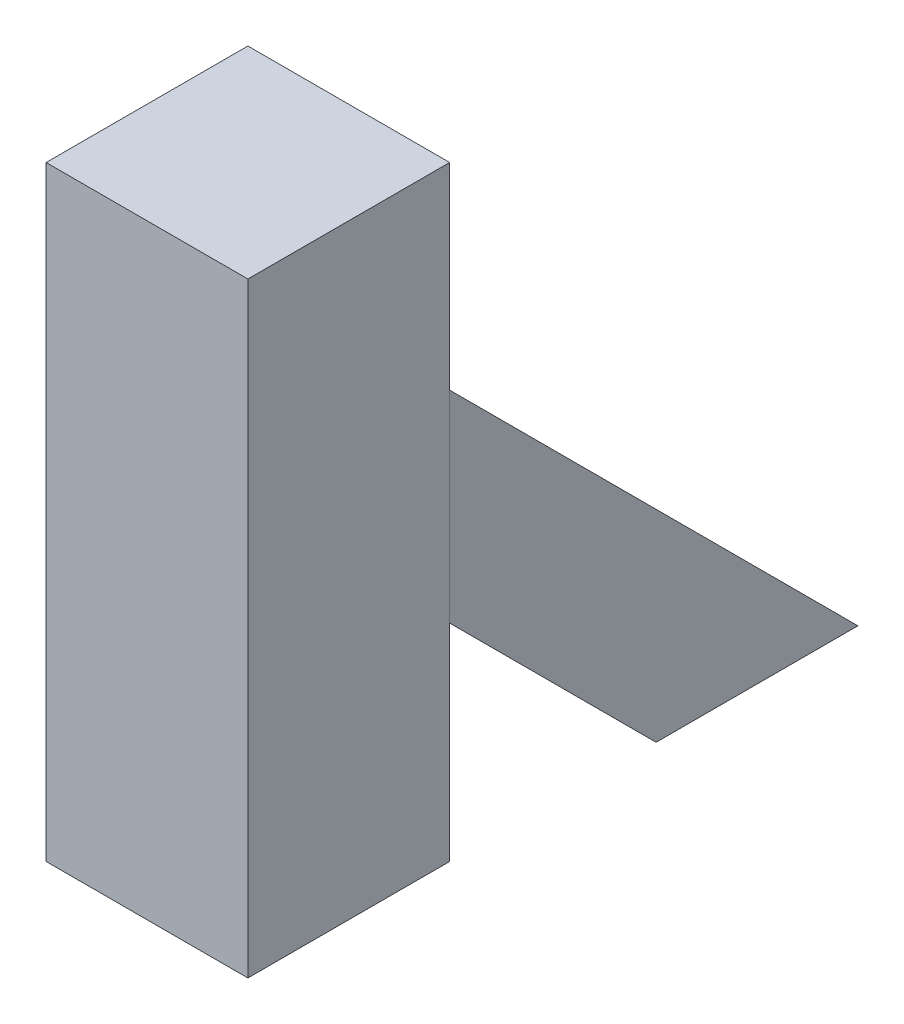
ISO-10303-21;
HEADER;
FILE_DESCRIPTION(('STEP AP214'),'2;1');
FILE_NAME('part.step','',(''),(''),'','','');
FILE_SCHEMA(('AUTOMOTIVE_DESIGN { 1 0 10303 214 1 1 1 1 }'));
ENDSEC;
DATA;
#1=APPLICATION_CONTEXT('core data for automotive mechanical design processes');
#2=APPLICATION_PROTOCOL_DEFINITION('international standard','automotive_design',2000,#1);
#3=PRODUCT_CONTEXT('',#1,'mechanical');
#4=PRODUCT('Part','Part','',(#3));
#5=PRODUCT_RELATED_PRODUCT_CATEGORY('part','',(#4));
#6=PRODUCT_DEFINITION_FORMATION('','',#4);
#7=PRODUCT_DEFINITION_CONTEXT('part definition',#1,'design');
#8=PRODUCT_DEFINITION('design','',#6,#7);
#9=PRODUCT_DEFINITION_SHAPE('','',#8);
#10=(LENGTH_UNIT() NAMED_UNIT(*) SI_UNIT(.MILLI.,.METRE.));
#11=(NAMED_UNIT(*) PLANE_ANGLE_UNIT() SI_UNIT($,.RADIAN.));
#12=(NAMED_UNIT(*) SI_UNIT($,.STERADIAN.) SOLID_ANGLE_UNIT());
#13=UNCERTAINTY_MEASURE_WITH_UNIT(LENGTH_MEASURE(1.E-05),#10,'distance_accuracy_value','');
#14=(GEOMETRIC_REPRESENTATION_CONTEXT(3) GLOBAL_UNCERTAINTY_ASSIGNED_CONTEXT((#13)) GLOBAL_UNIT_ASSIGNED_CONTEXT((#10,
#11,#12)) REPRESENTATION_CONTEXT('',''));
#15=CARTESIAN_POINT('',(0.,0.,0.));
#16=DIRECTION('',(0.,0.,1.));
#17=DIRECTION('',(1.,0.,0.));
#18=AXIS2_PLACEMENT_3D('',#15,#16,#17);
#19=CARTESIAN_POINT('',(-49.9999999999999,202.313201964456,-49.9999999999998));
#20=DIRECTION('',(0.,0.,1.));
#21=DIRECTION('',(1.,0.,0.));
#22=AXIS2_PLACEMENT_3D('',#19,#20,#21);
#23=PLANE('',#22);
#24=DIRECTION('',(0.,-1.,0.));
#25=VECTOR('',#24,1.);
#26=CARTESIAN_POINT('',(50.0000000000001,202.313201964456,-49.9999999999998));
#27=LINE('',#26,#25);
#28=CARTESIAN_POINT('',(50.0000000000001,202.313201964456,-49.9999999999998));
#29=VERTEX_POINT('',#28);
#30=CARTESIAN_POINT('',(50.0000000000001,102.313201964456,-49.9999999999998));
#31=VERTEX_POINT('',#30);
#32=EDGE_CURVE('E113',#29,#31,#27,.T.);
#33=ORIENTED_EDGE('',*,*,#32,.F.);
#34=DIRECTION('',(1.,0.,0.));
#35=VECTOR('',#34,1.);
#36=CARTESIAN_POINT('',(-49.9999999999999,202.313201964456,-49.9999999999998));
#37=LINE('',#36,#35);
#38=CARTESIAN_POINT('',(-49.9999999999999,202.313201964456,-49.9999999999998));
#39=VERTEX_POINT('',#38);
#40=EDGE_CURVE('E12',#39,#29,#37,.T.);
#41=ORIENTED_EDGE('',*,*,#40,.F.);
#42=DIRECTION('',(0.,-1.,0.));
#43=VECTOR('',#42,1.);
#44=CARTESIAN_POINT('',(-49.9999999999999,202.313201964456,-49.9999999999998));
#45=LINE('',#44,#43);
#46=CARTESIAN_POINT('',(-49.9999999999999,102.313201964456,-49.9999999999998));
#47=VERTEX_POINT('',#46);
#48=EDGE_CURVE('E107',#39,#47,#45,.T.);
#49=ORIENTED_EDGE('',*,*,#48,.T.);
#50=DIRECTION('',(1.,0.,0.));
#51=VECTOR('',#50,1.);
#52=CARTESIAN_POINT('',(-49.9999999999999,102.313201964456,-49.9999999999998));
#53=LINE('',#52,#51);
#54=EDGE_CURVE('E52',#47,#31,#53,.T.);
#55=ORIENTED_EDGE('',*,*,#54,.T.);
#56=EDGE_LOOP('',(#33,#41,#49,#55));
#57=FACE_BOUND('',#56,.T.);
#58=ADVANCED_FACE('F49',(#57),#23,.T.);
#59=CARTESIAN_POINT('',(-49.9999999999999,202.313201964456,-49.9999999999998));
#60=DIRECTION('',(0.,0.707106781186552,-0.707106781186543));
#61=DIRECTION('',(0.,0.707106781186543,0.707106781186552));
#62=AXIS2_PLACEMENT_3D('',#59,#60,#61);
#63=PLANE('',#62);
#64=DIRECTION('',(0.,0.707106781186543,0.707106781186551));
#65=VECTOR('',#64,1.);
#66=CARTESIAN_POINT('',(50.0000000000001,202.313201964456,-49.9999999999998));
#67=LINE('',#66,#65);
#68=CARTESIAN_POINT('',(50.0000000000001,0.,-252.313201964458));
#69=VERTEX_POINT('',#68);
#70=EDGE_CURVE('E109',#69,#29,#67,.T.);
#71=ORIENTED_EDGE('',*,*,#70,.F.);
#72=DIRECTION('',(1.,0.,0.));
#73=VECTOR('',#72,1.);
#74=CARTESIAN_POINT('',(-49.9999999999999,0.,-252.313201964458));
#75=LINE('',#74,#73);
#76=CARTESIAN_POINT('',(-49.9999999999999,0.,-252.313201964458));
#77=VERTEX_POINT('',#76);
#78=EDGE_CURVE('E58',#77,#69,#75,.T.);
#79=ORIENTED_EDGE('',*,*,#78,.F.);
#80=DIRECTION('',(0.,0.707106781186543,0.707106781186551));
#81=VECTOR('',#80,1.);
#82=CARTESIAN_POINT('',(-49.9999999999999,202.313201964456,-49.9999999999998));
#83=LINE('',#82,#81);
#84=EDGE_CURVE('E104',#77,#39,#83,.T.);
#85=ORIENTED_EDGE('',*,*,#84,.T.);
#86=ORIENTED_EDGE('',*,*,#40,.T.);
#87=EDGE_LOOP('',(#71,#79,#85,#86));
#88=FACE_BOUND('',#87,.T.);
#89=ADVANCED_FACE('F123',(#88),#63,.T.);
#90=CARTESIAN_POINT('',(-49.9999999999999,0.,-252.313201964458));
#91=DIRECTION('',(0.,-1.,0.));
#92=DIRECTION('',(0.,0.,-1.));
#93=AXIS2_PLACEMENT_3D('',#90,#91,#92);
#94=PLANE('',#93);
#95=DIRECTION('',(0.,0.,-1.));
#96=VECTOR('',#95,1.);
#97=CARTESIAN_POINT('',(50.0000000000001,0.,-252.313201964458));
#98=LINE('',#97,#96);
#99=CARTESIAN_POINT('',(50.0000000000001,0.,-152.313201964457));
#100=VERTEX_POINT('',#99);
#101=EDGE_CURVE('E99',#100,#69,#98,.T.);
#102=ORIENTED_EDGE('',*,*,#101,.F.);
#103=DIRECTION('',(1.,0.,0.));
#104=VECTOR('',#103,1.);
#105=CARTESIAN_POINT('',(-49.9999999999999,0.,-152.313201964457));
#106=LINE('',#105,#104);
#107=CARTESIAN_POINT('',(-49.9999999999999,0.,-152.313201964457));
#108=VERTEX_POINT('',#107);
#109=EDGE_CURVE('E94',#108,#100,#106,.T.);
#110=ORIENTED_EDGE('',*,*,#109,.F.);
#111=DIRECTION('',(0.,0.,-1.));
#112=VECTOR('',#111,1.);
#113=CARTESIAN_POINT('',(-49.9999999999999,0.,-252.313201964458));
#114=LINE('',#113,#112);
#115=EDGE_CURVE('E97',#108,#77,#114,.T.);
#116=ORIENTED_EDGE('',*,*,#115,.T.);
#117=ORIENTED_EDGE('',*,*,#78,.T.);
#118=EDGE_LOOP('',(#102,#110,#116,#117));
#119=FACE_BOUND('',#118,.T.);
#120=ADVANCED_FACE('F96',(#119),#94,.T.);
#121=CARTESIAN_POINT('',(-49.9999999999999,0.,-152.313201964457));
#122=DIRECTION('',(0.,-0.707106781186552,0.707106781186544));
#123=DIRECTION('',(0.,-0.707106781186544,-0.707106781186551));
#124=AXIS2_PLACEMENT_3D('',#121,#122,#123);
#125=PLANE('',#124);
#126=DIRECTION('',(0.,-0.707106781186544,-0.707106781186551));
#127=VECTOR('',#126,1.);
#128=CARTESIAN_POINT('',(50.0000000000001,0.,-152.313201964457));
#129=LINE('',#128,#127);
#130=EDGE_CURVE('E116',#31,#100,#129,.T.);
#131=ORIENTED_EDGE('',*,*,#130,.F.);
#132=ORIENTED_EDGE('',*,*,#54,.F.);
#133=DIRECTION('',(0.,-0.707106781186544,-0.707106781186551));
#134=VECTOR('',#133,1.);
#135=CARTESIAN_POINT('',(-49.9999999999999,0.,-152.313201964457));
#136=LINE('',#135,#134);
#137=EDGE_CURVE('E103',#47,#108,#136,.T.);
#138=ORIENTED_EDGE('',*,*,#137,.T.);
#139=ORIENTED_EDGE('',*,*,#109,.T.);
#140=EDGE_LOOP('',(#131,#132,#138,#139));
#141=FACE_BOUND('',#140,.T.);
#142=ADVANCED_FACE('F106',(#141),#125,.T.);
#143=CARTESIAN_POINT('',(-49.9999999999999,0.,0.));
#144=DIRECTION('',(-1.,0.,0.));
#145=DIRECTION('',(0.,0.,1.));
#146=AXIS2_PLACEMENT_3D('',#143,#144,#145);
#147=PLANE('',#146);
#148=ORIENTED_EDGE('',*,*,#48,.F.);
#149=ORIENTED_EDGE('',*,*,#84,.F.);
#150=ORIENTED_EDGE('',*,*,#115,.F.);
#151=ORIENTED_EDGE('',*,*,#137,.F.);
#152=EDGE_LOOP('',(#148,#149,#150,#151));
#153=FACE_BOUND('',#152,.T.);
#154=ADVANCED_FACE('F102',(#153),#147,.T.);
#155=CARTESIAN_POINT('',(50.0000000000001,0.,0.));
#156=DIRECTION('',(-1.,0.,0.));
#157=DIRECTION('',(0.,0.,1.));
#158=AXIS2_PLACEMENT_3D('',#155,#156,#157);
#159=PLANE('',#158);
#160=ORIENTED_EDGE('',*,*,#32,.T.);
#161=ORIENTED_EDGE('',*,*,#130,.T.);
#162=ORIENTED_EDGE('',*,*,#101,.T.);
#163=ORIENTED_EDGE('',*,*,#70,.T.);
#164=EDGE_LOOP('',(#160,#161,#162,#163));
#165=FACE_BOUND('',#164,.T.);
#166=ADVANCED_FACE('F122',(#165),#159,.F.);
#167=CLOSED_SHELL('',(#58,#89,#120,#142,#154,#166));
#168=MANIFOLD_SOLID_BREP('B2',#167);
#169=CARTESIAN_POINT('',(-49.9999999999999,300.,50.0000000000002));
#170=DIRECTION('',(1.,0.,0.));
#171=DIRECTION('',(0.,0.,-1.));
#172=AXIS2_PLACEMENT_3D('',#169,#170,#171);
#173=PLANE('',#172);
#174=DIRECTION('',(0.,0.,1.));
#175=VECTOR('',#174,1.);
#176=CARTESIAN_POINT('',(-49.9999999999999,0.,50.0000000000002));
#177=LINE('',#176,#175);
#178=CARTESIAN_POINT('',(-49.9999999999999,0.,-49.9999999999998));
#179=VERTEX_POINT('',#178);
#180=CARTESIAN_POINT('',(-49.9999999999999,0.,50.0000000000002));
#181=VERTEX_POINT('',#180);
#182=EDGE_CURVE('E241',#179,#181,#177,.T.);
#183=ORIENTED_EDGE('',*,*,#182,.T.);
#184=DIRECTION('',(0.,-1.,0.));
#185=VECTOR('',#184,1.);
#186=CARTESIAN_POINT('',(-49.9999999999999,300.,50.0000000000002));
#187=LINE('',#186,#185);
#188=CARTESIAN_POINT('',(-49.9999999999999,300.,50.0000000000002));
#189=VERTEX_POINT('',#188);
#190=EDGE_CURVE('E47',#189,#181,#187,.T.);
#191=ORIENTED_EDGE('',*,*,#190,.F.);
#192=DIRECTION('',(0.,0.,1.));
#193=VECTOR('',#192,1.);
#194=CARTESIAN_POINT('',(-49.9999999999999,300.,50.0000000000002));
#195=LINE('',#194,#193);
#196=CARTESIAN_POINT('',(-49.9999999999999,300.,-49.9999999999998));
#197=VERTEX_POINT('',#196);
#198=EDGE_CURVE('E225',#197,#189,#195,.T.);
#199=ORIENTED_EDGE('',*,*,#198,.F.);
#200=DIRECTION('',(0.,-1.,0.));
#201=VECTOR('',#200,1.);
#202=CARTESIAN_POINT('',(-49.9999999999999,300.,-49.9999999999998));
#203=LINE('',#202,#201);
#204=EDGE_CURVE('E237',#197,#179,#203,.T.);
#205=ORIENTED_EDGE('',*,*,#204,.T.);
#206=EDGE_LOOP('',(#183,#191,#199,#205));
#207=FACE_BOUND('',#206,.T.);
#208=ADVANCED_FACE('F173',(#207),#173,.F.);
#209=CARTESIAN_POINT('',(50.0000000000001,300.,50.0000000000002));
#210=DIRECTION('',(0.,0.,-1.));
#211=DIRECTION('',(-1.,0.,0.));
#212=AXIS2_PLACEMENT_3D('',#209,#210,#211);
#213=PLANE('',#212);
#214=DIRECTION('',(1.,0.,0.));
#215=VECTOR('',#214,1.);
#216=CARTESIAN_POINT('',(50.0000000000001,0.,50.0000000000002));
#217=LINE('',#216,#215);
#218=CARTESIAN_POINT('',(50.0000000000001,0.,50.0000000000002));
#219=VERTEX_POINT('',#218);
#220=EDGE_CURVE('E230',#181,#219,#217,.T.);
#221=ORIENTED_EDGE('',*,*,#220,.T.);
#222=DIRECTION('',(0.,-1.,0.));
#223=VECTOR('',#222,1.);
#224=CARTESIAN_POINT('',(50.0000000000001,300.,50.0000000000002));
#225=LINE('',#224,#223);
#226=CARTESIAN_POINT('',(50.0000000000001,300.,50.0000000000002));
#227=VERTEX_POINT('',#226);
#228=EDGE_CURVE('E182',#227,#219,#225,.T.);
#229=ORIENTED_EDGE('',*,*,#228,.F.);
#230=DIRECTION('',(1.,0.,0.));
#231=VECTOR('',#230,1.);
#232=CARTESIAN_POINT('',(50.0000000000001,300.,50.0000000000002));
#233=LINE('',#232,#231);
#234=EDGE_CURVE('E220',#189,#227,#233,.T.);
#235=ORIENTED_EDGE('',*,*,#234,.F.);
#236=ORIENTED_EDGE('',*,*,#190,.T.);
#237=EDGE_LOOP('',(#221,#229,#235,#236));
#238=FACE_BOUND('',#237,.T.);
#239=ADVANCED_FACE('F229',(#238),#213,.F.);
#240=CARTESIAN_POINT('',(50.0000000000001,300.,50.0000000000002));
#241=DIRECTION('',(-1.,0.,0.));
#242=DIRECTION('',(0.,0.,1.));
#243=AXIS2_PLACEMENT_3D('',#240,#241,#242);
#244=PLANE('',#243);
#245=DIRECTION('',(0.,0.,-1.));
#246=VECTOR('',#245,1.);
#247=CARTESIAN_POINT('',(50.0000000000001,0.,50.0000000000002));
#248=LINE('',#247,#246);
#249=CARTESIAN_POINT('',(50.0000000000001,0.,-49.9999999999998));
#250=VERTEX_POINT('',#249);
#251=EDGE_CURVE('E207',#219,#250,#248,.T.);
#252=ORIENTED_EDGE('',*,*,#251,.T.);
#253=DIRECTION('',(0.,-1.,0.));
#254=VECTOR('',#253,1.);
#255=CARTESIAN_POINT('',(50.0000000000001,300.,-49.9999999999998));
#256=LINE('',#255,#254);
#257=CARTESIAN_POINT('',(50.0000000000001,300.,-49.9999999999998));
#258=VERTEX_POINT('',#257);
#259=EDGE_CURVE('E232',#258,#250,#256,.T.);
#260=ORIENTED_EDGE('',*,*,#259,.F.);
#261=DIRECTION('',(0.,0.,-1.));
#262=VECTOR('',#261,1.);
#263=CARTESIAN_POINT('',(50.0000000000001,300.,50.0000000000002));
#264=LINE('',#263,#262);
#265=EDGE_CURVE('E223',#227,#258,#264,.T.);
#266=ORIENTED_EDGE('',*,*,#265,.F.);
#267=ORIENTED_EDGE('',*,*,#228,.T.);
#268=EDGE_LOOP('',(#252,#260,#266,#267));
#269=FACE_BOUND('',#268,.T.);
#270=ADVANCED_FACE('F233',(#269),#244,.F.);
#271=CARTESIAN_POINT('',(50.0000000000001,300.,-49.9999999999998));
#272=DIRECTION('',(0.,0.,1.));
#273=DIRECTION('',(1.,0.,0.));
#274=AXIS2_PLACEMENT_3D('',#271,#272,#273);
#275=PLANE('',#274);
#276=DIRECTION('',(-1.,0.,0.));
#277=VECTOR('',#276,1.);
#278=CARTESIAN_POINT('',(50.0000000000001,0.,-49.9999999999998));
#279=LINE('',#278,#277);
#280=EDGE_CURVE('E213',#250,#179,#279,.T.);
#281=ORIENTED_EDGE('',*,*,#280,.T.);
#282=ORIENTED_EDGE('',*,*,#204,.F.);
#283=DIRECTION('',(-1.,0.,0.));
#284=VECTOR('',#283,1.);
#285=CARTESIAN_POINT('',(50.0000000000001,300.,-49.9999999999998));
#286=LINE('',#285,#284);
#287=EDGE_CURVE('E190',#258,#197,#286,.T.);
#288=ORIENTED_EDGE('',*,*,#287,.F.);
#289=ORIENTED_EDGE('',*,*,#259,.T.);
#290=EDGE_LOOP('',(#281,#282,#288,#289));
#291=FACE_BOUND('',#290,.T.);
#292=ADVANCED_FACE('F254',(#291),#275,.F.);
#293=CARTESIAN_POINT('',(0.,300.,0.));
#294=DIRECTION('',(0.,1.,0.));
#295=DIRECTION('',(0.,0.,1.));
#296=AXIS2_PLACEMENT_3D('',#293,#294,#295);
#297=PLANE('',#296);
#298=ORIENTED_EDGE('',*,*,#198,.T.);
#299=ORIENTED_EDGE('',*,*,#234,.T.);
#300=ORIENTED_EDGE('',*,*,#265,.T.);
#301=ORIENTED_EDGE('',*,*,#287,.T.);
#302=EDGE_LOOP('',(#298,#299,#300,#301));
#303=FACE_BOUND('',#302,.T.);
#304=ADVANCED_FACE('F221',(#303),#297,.T.);
#305=CARTESIAN_POINT('',(0.,0.,0.));
#306=DIRECTION('',(0.,1.,0.));
#307=DIRECTION('',(0.,0.,1.));
#308=AXIS2_PLACEMENT_3D('',#305,#306,#307);
#309=PLANE('',#308);
#310=ORIENTED_EDGE('',*,*,#182,.F.);
#311=ORIENTED_EDGE('',*,*,#280,.F.);
#312=ORIENTED_EDGE('',*,*,#251,.F.);
#313=ORIENTED_EDGE('',*,*,#220,.F.);
#314=EDGE_LOOP('',(#310,#311,#312,#313));
#315=FACE_BOUND('',#314,.T.);
#316=ADVANCED_FACE('F257',(#315),#309,.F.);
#317=CLOSED_SHELL('',(#208,#239,#270,#292,#304,#316));
#318=MANIFOLD_SOLID_BREP('B6',#317);
#319=ADVANCED_BREP_SHAPE_REPRESENTATION('',(#18,#168,#318),#14);
#320=SHAPE_DEFINITION_REPRESENTATION(#9,#319);
ENDSEC;
END-ISO-10303-21;
